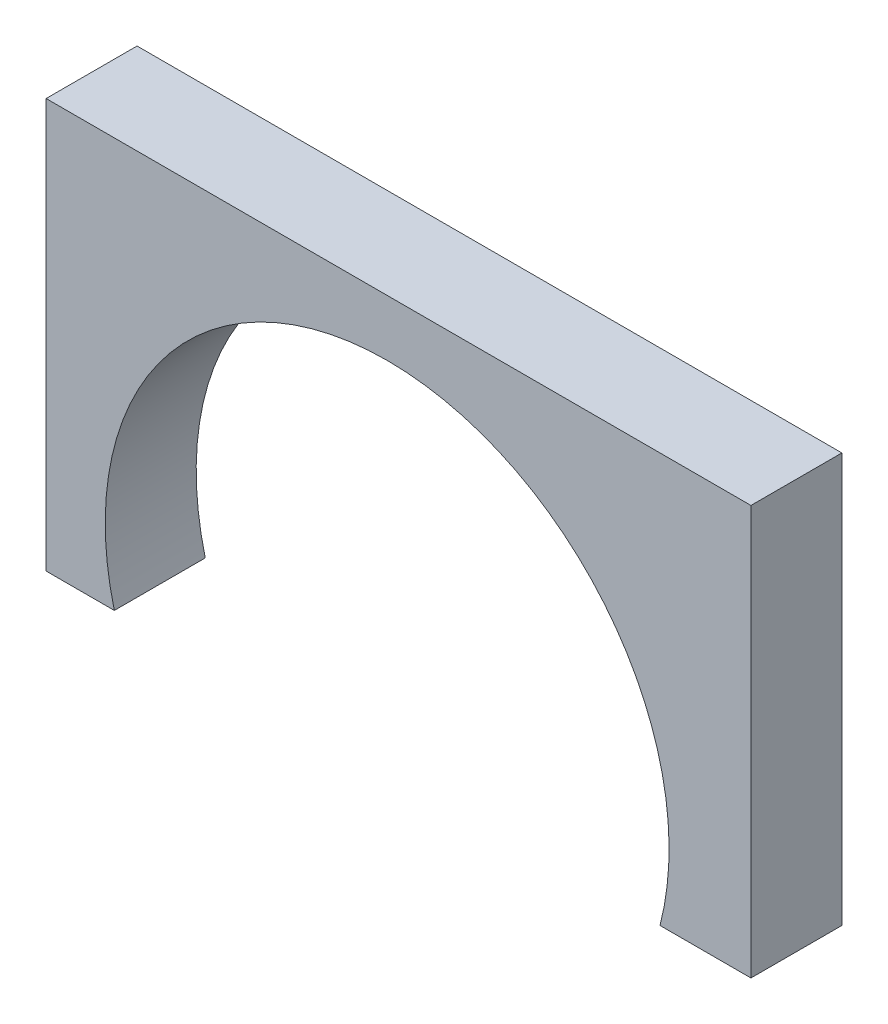
ISO-10303-21;
HEADER;
FILE_DESCRIPTION(('STEP AP214'),'2;1');
FILE_NAME('part.step','',(''),(''),'','','');
FILE_SCHEMA(('AUTOMOTIVE_DESIGN { 1 0 10303 214 1 1 1 1 }'));
ENDSEC;
DATA;
#1=APPLICATION_CONTEXT('core data for automotive mechanical design processes');
#2=APPLICATION_PROTOCOL_DEFINITION('international standard','automotive_design',2000,#1);
#3=PRODUCT_CONTEXT('',#1,'mechanical');
#4=PRODUCT('Part','Part','',(#3));
#5=PRODUCT_RELATED_PRODUCT_CATEGORY('part','',(#4));
#6=PRODUCT_DEFINITION_FORMATION('','',#4);
#7=PRODUCT_DEFINITION_CONTEXT('part definition',#1,'design');
#8=PRODUCT_DEFINITION('design','',#6,#7);
#9=PRODUCT_DEFINITION_SHAPE('','',#8);
#10=(LENGTH_UNIT() NAMED_UNIT(*) SI_UNIT(.MILLI.,.METRE.));
#11=(NAMED_UNIT(*) PLANE_ANGLE_UNIT() SI_UNIT($,.RADIAN.));
#12=(NAMED_UNIT(*) SI_UNIT($,.STERADIAN.) SOLID_ANGLE_UNIT());
#13=UNCERTAINTY_MEASURE_WITH_UNIT(LENGTH_MEASURE(1.E-05),#10,'distance_accuracy_value','');
#14=(GEOMETRIC_REPRESENTATION_CONTEXT(3) GLOBAL_UNCERTAINTY_ASSIGNED_CONTEXT((#13)) GLOBAL_UNIT_ASSIGNED_CONTEXT((#10,
#11,#12)) REPRESENTATION_CONTEXT('',''));
#15=CARTESIAN_POINT('',(0.,0.,0.));
#16=DIRECTION('',(0.,0.,1.));
#17=DIRECTION('',(1.,0.,0.));
#18=AXIS2_PLACEMENT_3D('',#15,#16,#17);
#19=CARTESIAN_POINT('',(-75.,74.3795006481867,20.));
#20=DIRECTION('',(0.,-1.,0.));
#21=DIRECTION('',(0.,0.,-1.));
#22=AXIS2_PLACEMENT_3D('',#19,#20,#21);
#23=PLANE('',#22);
#24=DIRECTION('',(-1.,0.,0.));
#25=VECTOR('',#24,1.);
#26=CARTESIAN_POINT('',(-75.,74.3795006481867,0.));
#27=LINE('',#26,#25);
#28=CARTESIAN_POINT('',(80.,74.3795006481867,0.));
#29=VERTEX_POINT('',#28);
#30=CARTESIAN_POINT('',(-75.,74.3795006481867,0.));
#31=VERTEX_POINT('',#30);
#32=EDGE_CURVE('E117',#29,#31,#27,.T.);
#33=ORIENTED_EDGE('',*,*,#32,.T.);
#34=DIRECTION('',(0.,0.,-1.));
#35=VECTOR('',#34,1.);
#36=CARTESIAN_POINT('',(-75.,74.3795006481867,20.));
#37=LINE('',#36,#35);
#38=CARTESIAN_POINT('',(-75.,74.3795006481867,20.));
#39=VERTEX_POINT('',#38);
#40=EDGE_CURVE('E11',#39,#31,#37,.T.);
#41=ORIENTED_EDGE('',*,*,#40,.F.);
#42=DIRECTION('',(-1.,0.,0.));
#43=VECTOR('',#42,1.);
#44=CARTESIAN_POINT('',(-75.,74.3795006481867,20.));
#45=LINE('',#44,#43);
#46=CARTESIAN_POINT('',(80.,74.3795006481867,20.));
#47=VERTEX_POINT('',#46);
#48=EDGE_CURVE('E127',#47,#39,#45,.T.);
#49=ORIENTED_EDGE('',*,*,#48,.F.);
#50=DIRECTION('',(0.,0.,-1.));
#51=VECTOR('',#50,1.);
#52=CARTESIAN_POINT('',(80.,74.3795006481867,20.));
#53=LINE('',#52,#51);
#54=EDGE_CURVE('E113',#47,#29,#53,.T.);
#55=ORIENTED_EDGE('',*,*,#54,.T.);
#56=EDGE_LOOP('',(#33,#41,#49,#55));
#57=FACE_BOUND('',#56,.T.);
#58=ADVANCED_FACE('F33',(#57),#23,.F.);
#59=CARTESIAN_POINT('',(-75.,74.3795006481867,20.));
#60=DIRECTION('',(1.,0.,0.));
#61=DIRECTION('',(0.,1.,0.));
#62=AXIS2_PLACEMENT_3D('',#59,#60,#61);
#63=PLANE('',#62);
#64=DIRECTION('',(0.,-1.,0.));
#65=VECTOR('',#64,1.);
#66=CARTESIAN_POINT('',(-75.,74.3795006481867,0.));
#67=LINE('',#66,#65);
#68=CARTESIAN_POINT('',(-75.,-15.6204993518133,0.));
#69=VERTEX_POINT('',#68);
#70=EDGE_CURVE('E120',#31,#69,#67,.T.);
#71=ORIENTED_EDGE('',*,*,#70,.T.);
#72=DIRECTION('',(0.,0.,-1.));
#73=VECTOR('',#72,1.);
#74=CARTESIAN_POINT('',(-75.,-15.6204993518133,20.));
#75=LINE('',#74,#73);
#76=CARTESIAN_POINT('',(-75.,-15.6204993518133,20.));
#77=VERTEX_POINT('',#76);
#78=EDGE_CURVE('E41',#77,#69,#75,.T.);
#79=ORIENTED_EDGE('',*,*,#78,.F.);
#80=DIRECTION('',(0.,-1.,0.));
#81=VECTOR('',#80,1.);
#82=CARTESIAN_POINT('',(-75.,74.3795006481867,20.));
#83=LINE('',#82,#81);
#84=EDGE_CURVE('E86',#39,#77,#83,.T.);
#85=ORIENTED_EDGE('',*,*,#84,.F.);
#86=ORIENTED_EDGE('',*,*,#40,.T.);
#87=EDGE_LOOP('',(#71,#79,#85,#86));
#88=FACE_BOUND('',#87,.T.);
#89=ADVANCED_FACE('F151',(#88),#63,.F.);
#90=CARTESIAN_POINT('',(-60.,-15.6204993518133,20.));
#91=DIRECTION('',(0.,1.,0.));
#92=DIRECTION('',(-1.,0.,0.));
#93=AXIS2_PLACEMENT_3D('',#90,#91,#92);
#94=PLANE('',#93);
#95=DIRECTION('',(1.,0.,0.));
#96=VECTOR('',#95,1.);
#97=CARTESIAN_POINT('',(-60.,-15.6204993518133,0.));
#98=LINE('',#97,#96);
#99=CARTESIAN_POINT('',(-60.,-15.6204993518133,0.));
#100=VERTEX_POINT('',#99);
#101=EDGE_CURVE('E122',#69,#100,#98,.T.);
#102=ORIENTED_EDGE('',*,*,#101,.T.);
#103=DIRECTION('',(0.,0.,-1.));
#104=VECTOR('',#103,1.);
#105=CARTESIAN_POINT('',(-60.,-15.6204993518133,20.));
#106=LINE('',#105,#104);
#107=CARTESIAN_POINT('',(-60.,-15.6204993518133,20.));
#108=VERTEX_POINT('',#107);
#109=EDGE_CURVE('E108',#108,#100,#106,.T.);
#110=ORIENTED_EDGE('',*,*,#109,.F.);
#111=DIRECTION('',(1.,0.,0.));
#112=VECTOR('',#111,1.);
#113=CARTESIAN_POINT('',(-60.,-15.6204993518133,20.));
#114=LINE('',#113,#112);
#115=EDGE_CURVE('E99',#77,#108,#114,.T.);
#116=ORIENTED_EDGE('',*,*,#115,.F.);
#117=ORIENTED_EDGE('',*,*,#78,.T.);
#118=EDGE_LOOP('',(#102,#110,#116,#117));
#119=FACE_BOUND('',#118,.T.);
#120=ADVANCED_FACE('F133',(#119),#94,.F.);
#121=CARTESIAN_POINT('',(0.,0.,20.));
#122=DIRECTION('',(0.,0.,-1.));
#123=DIRECTION('',(-1.,0.,0.));
#124=AXIS2_PLACEMENT_3D('',#121,#122,#123);
#125=CYLINDRICAL_SURFACE('',#124,62.);
#126=CARTESIAN_POINT('',(0.,0.,0.));
#127=DIRECTION('',(0.,0.,-1.));
#128=DIRECTION('',(1.,0.,0.));
#129=AXIS2_PLACEMENT_3D('',#126,#127,#128);
#130=CIRCLE('',#129,62.);
#131=CARTESIAN_POINT('',(60.,-15.6204993518133,0.));
#132=VERTEX_POINT('',#131);
#133=EDGE_CURVE('E107',#100,#132,#130,.T.);
#134=ORIENTED_EDGE('',*,*,#133,.T.);
#135=DIRECTION('',(0.,0.,-1.));
#136=VECTOR('',#135,1.);
#137=CARTESIAN_POINT('',(60.,-15.6204993518133,20.));
#138=LINE('',#137,#136);
#139=CARTESIAN_POINT('',(60.,-15.6204993518133,20.));
#140=VERTEX_POINT('',#139);
#141=EDGE_CURVE('E104',#140,#132,#138,.T.);
#142=ORIENTED_EDGE('',*,*,#141,.F.);
#143=CARTESIAN_POINT('',(0.,0.,20.));
#144=DIRECTION('',(0.,0.,-1.));
#145=DIRECTION('',(1.,0.,0.));
#146=AXIS2_PLACEMENT_3D('',#143,#144,#145);
#147=CIRCLE('',#146,62.);
#148=EDGE_CURVE('E93',#108,#140,#147,.T.);
#149=ORIENTED_EDGE('',*,*,#148,.F.);
#150=ORIENTED_EDGE('',*,*,#109,.T.);
#151=EDGE_LOOP('',(#134,#142,#149,#150));
#152=FACE_BOUND('',#151,.T.);
#153=ADVANCED_FACE('F105',(#152),#125,.F.);
#154=CARTESIAN_POINT('',(60.,-15.6204993518133,20.));
#155=DIRECTION('',(0.,1.,0.));
#156=DIRECTION('',(0.,0.,1.));
#157=AXIS2_PLACEMENT_3D('',#154,#155,#156);
#158=PLANE('',#157);
#159=DIRECTION('',(1.,0.,0.));
#160=VECTOR('',#159,1.);
#161=CARTESIAN_POINT('',(60.,-15.6204993518133,0.));
#162=LINE('',#161,#160);
#163=CARTESIAN_POINT('',(80.,-15.6204993518133,0.));
#164=VERTEX_POINT('',#163);
#165=EDGE_CURVE('E72',#132,#164,#162,.T.);
#166=ORIENTED_EDGE('',*,*,#165,.T.);
#167=DIRECTION('',(0.,0.,-1.));
#168=VECTOR('',#167,1.);
#169=CARTESIAN_POINT('',(80.,-15.6204993518133,20.));
#170=LINE('',#169,#168);
#171=CARTESIAN_POINT('',(80.,-15.6204993518133,20.));
#172=VERTEX_POINT('',#171);
#173=EDGE_CURVE('E109',#172,#164,#170,.T.);
#174=ORIENTED_EDGE('',*,*,#173,.F.);
#175=DIRECTION('',(1.,0.,0.));
#176=VECTOR('',#175,1.);
#177=CARTESIAN_POINT('',(60.,-15.6204993518133,20.));
#178=LINE('',#177,#176);
#179=EDGE_CURVE('E97',#140,#172,#178,.T.);
#180=ORIENTED_EDGE('',*,*,#179,.F.);
#181=ORIENTED_EDGE('',*,*,#141,.T.);
#182=EDGE_LOOP('',(#166,#174,#180,#181));
#183=FACE_BOUND('',#182,.T.);
#184=ADVANCED_FACE('F111',(#183),#158,.F.);
#185=CARTESIAN_POINT('',(80.,74.3795006481867,20.));
#186=DIRECTION('',(-1.,0.,0.));
#187=DIRECTION('',(0.,-1.,0.));
#188=AXIS2_PLACEMENT_3D('',#185,#186,#187);
#189=PLANE('',#188);
#190=DIRECTION('',(0.,1.,0.));
#191=VECTOR('',#190,1.);
#192=CARTESIAN_POINT('',(80.,74.3795006481867,0.));
#193=LINE('',#192,#191);
#194=EDGE_CURVE('E78',#164,#29,#193,.T.);
#195=ORIENTED_EDGE('',*,*,#194,.T.);
#196=ORIENTED_EDGE('',*,*,#54,.F.);
#197=DIRECTION('',(0.,1.,0.));
#198=VECTOR('',#197,1.);
#199=CARTESIAN_POINT('',(80.,74.3795006481867,20.));
#200=LINE('',#199,#198);
#201=EDGE_CURVE('E49',#172,#47,#200,.T.);
#202=ORIENTED_EDGE('',*,*,#201,.F.);
#203=ORIENTED_EDGE('',*,*,#173,.T.);
#204=EDGE_LOOP('',(#195,#196,#202,#203));
#205=FACE_BOUND('',#204,.T.);
#206=ADVANCED_FACE('F140',(#205),#189,.F.);
#207=CARTESIAN_POINT('',(0.,0.,20.));
#208=DIRECTION('',(0.,0.,1.));
#209=DIRECTION('',(1.,0.,0.));
#210=AXIS2_PLACEMENT_3D('',#207,#208,#209);
#211=PLANE('',#210);
#212=ORIENTED_EDGE('',*,*,#48,.T.);
#213=ORIENTED_EDGE('',*,*,#84,.T.);
#214=ORIENTED_EDGE('',*,*,#115,.T.);
#215=ORIENTED_EDGE('',*,*,#148,.T.);
#216=ORIENTED_EDGE('',*,*,#179,.T.);
#217=ORIENTED_EDGE('',*,*,#201,.T.);
#218=EDGE_LOOP('',(#212,#213,#214,#215,#216,#217));
#219=FACE_BOUND('',#218,.T.);
#220=ADVANCED_FACE('F95',(#219),#211,.T.);
#221=CARTESIAN_POINT('',(0.,0.,0.));
#222=DIRECTION('',(0.,0.,1.));
#223=DIRECTION('',(1.,0.,0.));
#224=AXIS2_PLACEMENT_3D('',#221,#222,#223);
#225=PLANE('',#224);
#226=ORIENTED_EDGE('',*,*,#32,.F.);
#227=ORIENTED_EDGE('',*,*,#194,.F.);
#228=ORIENTED_EDGE('',*,*,#165,.F.);
#229=ORIENTED_EDGE('',*,*,#133,.F.);
#230=ORIENTED_EDGE('',*,*,#101,.F.);
#231=ORIENTED_EDGE('',*,*,#70,.F.);
#232=EDGE_LOOP('',(#226,#227,#228,#229,#230,#231));
#233=FACE_BOUND('',#232,.T.);
#234=ADVANCED_FACE('F136',(#233),#225,.F.);
#235=CLOSED_SHELL('',(#58,#89,#120,#153,#184,#206,#220,#234));
#236=MANIFOLD_SOLID_BREP('B2',#235);
#237=ADVANCED_BREP_SHAPE_REPRESENTATION('',(#18,#236),#14);
#238=SHAPE_DEFINITION_REPRESENTATION(#9,#237);
ENDSEC;
END-ISO-10303-21;
